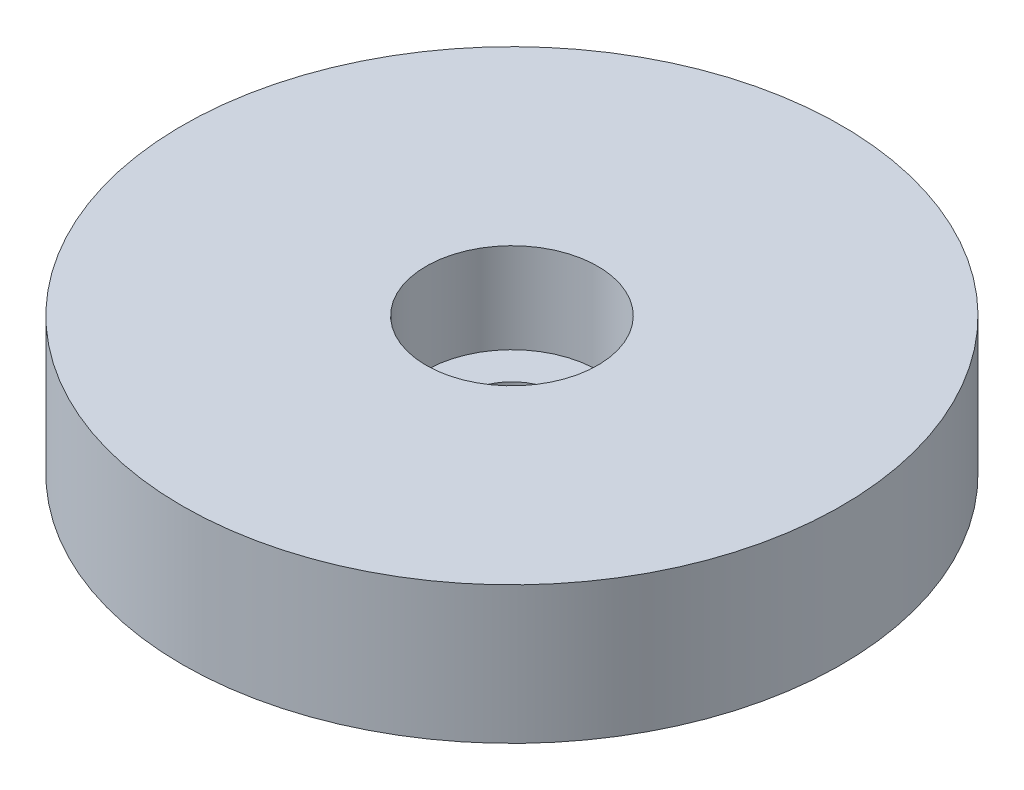
ISO-10303-21;
HEADER;
FILE_DESCRIPTION(('STEP AP214'),'2;1');
FILE_NAME('part.step','',(''),(''),'','','');
FILE_SCHEMA(('AUTOMOTIVE_DESIGN { 1 0 10303 214 1 1 1 1 }'));
ENDSEC;
DATA;
#1=APPLICATION_CONTEXT('core data for automotive mechanical design processes');
#2=APPLICATION_PROTOCOL_DEFINITION('international standard','automotive_design',2000,#1);
#3=PRODUCT_CONTEXT('',#1,'mechanical');
#4=PRODUCT('Part','Part','',(#3));
#5=PRODUCT_RELATED_PRODUCT_CATEGORY('part','',(#4));
#6=PRODUCT_DEFINITION_FORMATION('','',#4);
#7=PRODUCT_DEFINITION_CONTEXT('part definition',#1,'design');
#8=PRODUCT_DEFINITION('design','',#6,#7);
#9=PRODUCT_DEFINITION_SHAPE('','',#8);
#10=(LENGTH_UNIT() NAMED_UNIT(*) SI_UNIT(.MILLI.,.METRE.));
#11=(NAMED_UNIT(*) PLANE_ANGLE_UNIT() SI_UNIT($,.RADIAN.));
#12=(NAMED_UNIT(*) SI_UNIT($,.STERADIAN.) SOLID_ANGLE_UNIT());
#13=UNCERTAINTY_MEASURE_WITH_UNIT(LENGTH_MEASURE(1.E-05),#10,'distance_accuracy_value','');
#14=(GEOMETRIC_REPRESENTATION_CONTEXT(3) GLOBAL_UNCERTAINTY_ASSIGNED_CONTEXT((#13)) GLOBAL_UNIT_ASSIGNED_CONTEXT((#10,
#11,#12)) REPRESENTATION_CONTEXT('',''));
#15=CARTESIAN_POINT('',(0.,0.,0.));
#16=DIRECTION('',(0.,0.,1.));
#17=DIRECTION('',(1.,0.,0.));
#18=AXIS2_PLACEMENT_3D('',#15,#16,#17);
#19=CARTESIAN_POINT('',(0.,6.35,0.));
#20=DIRECTION('',(0.,-1.,0.));
#21=DIRECTION('',(0.,0.,-1.));
#22=AXIS2_PLACEMENT_3D('',#19,#20,#21);
#23=CYLINDRICAL_SURFACE('',#22,15.24);
#24=CARTESIAN_POINT('',(0.,6.35,0.));
#25=DIRECTION('',(0.,1.,0.));
#26=DIRECTION('',(0.,0.,1.));
#27=AXIS2_PLACEMENT_3D('',#24,#25,#26);
#28=CIRCLE('',#27,15.24);
#29=CARTESIAN_POINT('',(0.,6.35,15.24));
#30=VERTEX_POINT('',#29);
#31=EDGE_CURVE('E10',#30,#30,#28,.T.);
#32=ORIENTED_EDGE('',*,*,#31,.F.);
#33=EDGE_LOOP('',(#32));
#34=FACE_BOUND('',#33,.T.);
#35=CARTESIAN_POINT('',(0.,0.,0.));
#36=DIRECTION('',(0.,1.,0.));
#37=DIRECTION('',(0.,0.,1.));
#38=AXIS2_PLACEMENT_3D('',#35,#36,#37);
#39=CIRCLE('',#38,15.24);
#40=CARTESIAN_POINT('',(0.,0.,15.24));
#41=VERTEX_POINT('',#40);
#42=EDGE_CURVE('E35',#41,#41,#39,.T.);
#43=ORIENTED_EDGE('',*,*,#42,.T.);
#44=EDGE_LOOP('',(#43));
#45=FACE_BOUND('',#44,.T.);
#46=ADVANCED_FACE('F32',(#34,#45),#23,.T.);
#47=CARTESIAN_POINT('',(0.,6.35,0.));
#48=DIRECTION('',(0.,1.,0.));
#49=DIRECTION('',(0.,0.,1.));
#50=AXIS2_PLACEMENT_3D('',#47,#48,#49);
#51=PLANE('',#50);
#52=CARTESIAN_POINT('',(0.,6.35,0.));
#53=DIRECTION('',(0.,1.,0.));
#54=DIRECTION('',(0.,0.,1.));
#55=AXIS2_PLACEMENT_3D('',#52,#53,#54);
#56=CIRCLE('',#55,3.96875);
#57=CARTESIAN_POINT('',(0.,6.35,3.96875));
#58=VERTEX_POINT('',#57);
#59=EDGE_CURVE('E52',#58,#58,#56,.T.);
#60=ORIENTED_EDGE('',*,*,#59,.F.);
#61=EDGE_LOOP('',(#60));
#62=FACE_BOUND('',#61,.T.);
#63=ORIENTED_EDGE('',*,*,#31,.T.);
#64=EDGE_LOOP('',(#63));
#65=FACE_BOUND('',#64,.T.);
#66=ADVANCED_FACE('F58',(#62,#65),#51,.T.);
#67=CARTESIAN_POINT('',(0.,0.,0.));
#68=DIRECTION('',(0.,1.,0.));
#69=DIRECTION('',(0.,0.,1.));
#70=AXIS2_PLACEMENT_3D('',#67,#68,#69);
#71=PLANE('',#70);
#72=CARTESIAN_POINT('',(0.,0.,0.));
#73=DIRECTION('',(0.,1.,0.));
#74=DIRECTION('',(0.,0.,1.));
#75=AXIS2_PLACEMENT_3D('',#72,#73,#74);
#76=CIRCLE('',#75,2.15265);
#77=CARTESIAN_POINT('',(0.,0.,2.15265));
#78=VERTEX_POINT('',#77);
#79=EDGE_CURVE('E42',#78,#78,#76,.T.);
#80=ORIENTED_EDGE('',*,*,#79,.T.);
#81=EDGE_LOOP('',(#80));
#82=FACE_BOUND('',#81,.T.);
#83=ORIENTED_EDGE('',*,*,#42,.F.);
#84=EDGE_LOOP('',(#83));
#85=FACE_BOUND('',#84,.T.);
#86=ADVANCED_FACE('F60',(#82,#85),#71,.F.);
#87=CARTESIAN_POINT('',(0.,6.35,0.));
#88=DIRECTION('',(0.,1.,0.));
#89=DIRECTION('',(0.,0.,1.));
#90=AXIS2_PLACEMENT_3D('',#87,#88,#89);
#91=CYLINDRICAL_SURFACE('',#90,2.15265);
#92=ORIENTED_EDGE('',*,*,#79,.F.);
#93=EDGE_LOOP('',(#92));
#94=FACE_BOUND('',#93,.T.);
#95=CARTESIAN_POINT('',(0.,2.1844,0.));
#96=DIRECTION('',(0.,1.,0.));
#97=DIRECTION('',(0.,0.,1.));
#98=AXIS2_PLACEMENT_3D('',#95,#96,#97);
#99=CIRCLE('',#98,2.15265);
#100=CARTESIAN_POINT('',(0.,2.1844,2.15265));
#101=VERTEX_POINT('',#100);
#102=EDGE_CURVE('E46',#101,#101,#99,.T.);
#103=ORIENTED_EDGE('',*,*,#102,.T.);
#104=EDGE_LOOP('',(#103));
#105=FACE_BOUND('',#104,.T.);
#106=ADVANCED_FACE('F66',(#94,#105),#91,.F.);
#107=CARTESIAN_POINT('',(2.15265,2.1844,0.));
#108=DIRECTION('',(0.,-1.,0.));
#109=DIRECTION('',(0.,0.,-1.));
#110=AXIS2_PLACEMENT_3D('',#107,#108,#109);
#111=PLANE('',#110);
#112=ORIENTED_EDGE('',*,*,#102,.F.);
#113=EDGE_LOOP('',(#112));
#114=FACE_BOUND('',#113,.T.);
#115=CARTESIAN_POINT('',(0.,2.1844,0.));
#116=DIRECTION('',(0.,1.,0.));
#117=DIRECTION('',(0.,0.,1.));
#118=AXIS2_PLACEMENT_3D('',#115,#116,#117);
#119=CIRCLE('',#118,3.96875);
#120=CARTESIAN_POINT('',(0.,2.1844,3.96875));
#121=VERTEX_POINT('',#120);
#122=EDGE_CURVE('E49',#121,#121,#119,.T.);
#123=ORIENTED_EDGE('',*,*,#122,.T.);
#124=EDGE_LOOP('',(#123));
#125=FACE_BOUND('',#124,.T.);
#126=ADVANCED_FACE('F72',(#114,#125),#111,.F.);
#127=CARTESIAN_POINT('',(0.,6.35,0.));
#128=DIRECTION('',(0.,1.,0.));
#129=DIRECTION('',(0.,0.,1.));
#130=AXIS2_PLACEMENT_3D('',#127,#128,#129);
#131=CYLINDRICAL_SURFACE('',#130,3.96875);
#132=ORIENTED_EDGE('',*,*,#122,.F.);
#133=EDGE_LOOP('',(#132));
#134=FACE_BOUND('',#133,.T.);
#135=ORIENTED_EDGE('',*,*,#59,.T.);
#136=EDGE_LOOP('',(#135));
#137=FACE_BOUND('',#136,.T.);
#138=ADVANCED_FACE('F56',(#134,#137),#131,.F.);
#139=CLOSED_SHELL('',(#46,#66,#86,#106,#126,#138));
#140=MANIFOLD_SOLID_BREP('B2',#139);
#141=ADVANCED_BREP_SHAPE_REPRESENTATION('',(#18,#140),#14);
#142=SHAPE_DEFINITION_REPRESENTATION(#9,#141);
ENDSEC;
END-ISO-10303-21;
